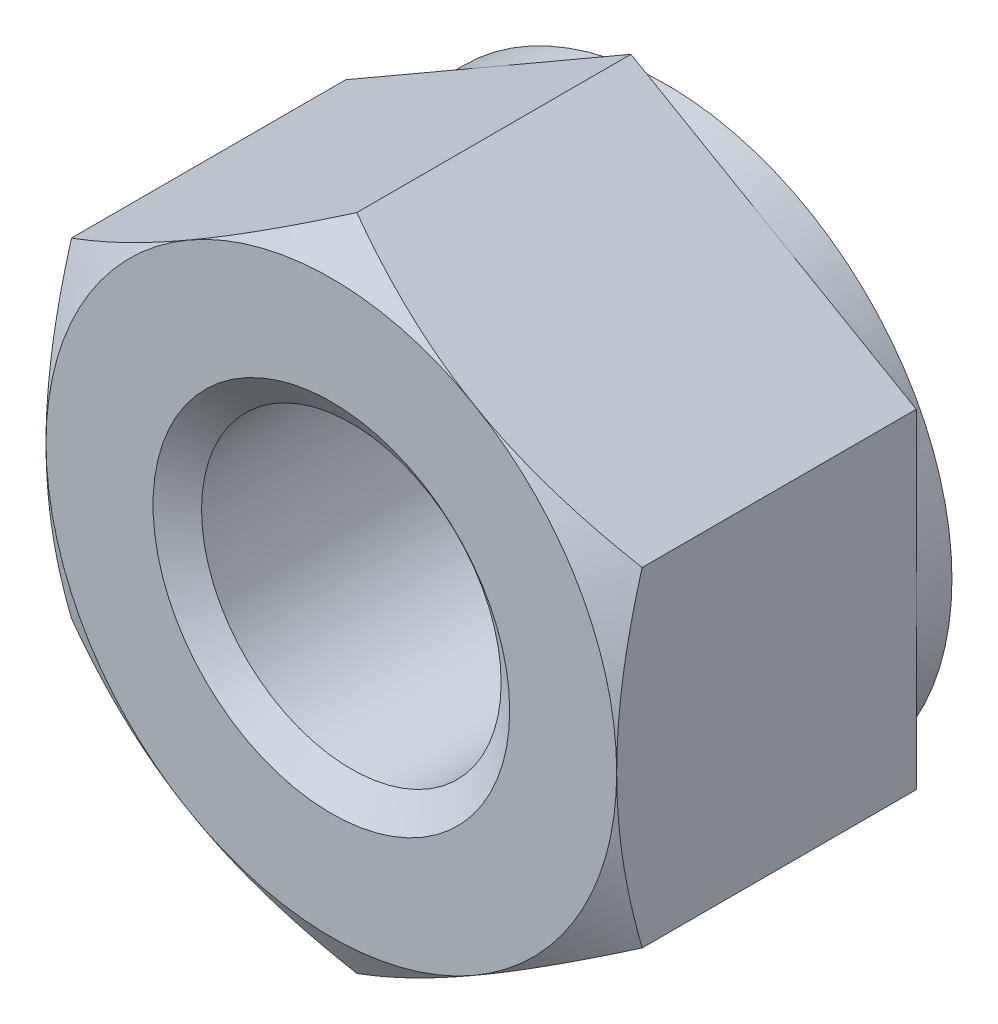
ISO-10303-21;
HEADER;
FILE_DESCRIPTION(('STEP AP214'),'2;1');
FILE_NAME('part.step','',(''),(''),'','','');
FILE_SCHEMA(('AUTOMOTIVE_DESIGN { 1 0 10303 214 1 1 1 1 }'));
ENDSEC;
DATA;
#1=APPLICATION_CONTEXT('core data for automotive mechanical design processes');
#2=APPLICATION_PROTOCOL_DEFINITION('international standard','automotive_design',2000,#1);
#3=PRODUCT_CONTEXT('',#1,'mechanical');
#4=PRODUCT('Part','Part','',(#3));
#5=PRODUCT_RELATED_PRODUCT_CATEGORY('part','',(#4));
#6=PRODUCT_DEFINITION_FORMATION('','',#4);
#7=PRODUCT_DEFINITION_CONTEXT('part definition',#1,'design');
#8=PRODUCT_DEFINITION('design','',#6,#7);
#9=PRODUCT_DEFINITION_SHAPE('','',#8);
#10=(LENGTH_UNIT() NAMED_UNIT(*) SI_UNIT(.MILLI.,.METRE.));
#11=(NAMED_UNIT(*) PLANE_ANGLE_UNIT() SI_UNIT($,.RADIAN.));
#12=(NAMED_UNIT(*) SI_UNIT($,.STERADIAN.) SOLID_ANGLE_UNIT());
#13=UNCERTAINTY_MEASURE_WITH_UNIT(LENGTH_MEASURE(1.E-05),#10,'distance_accuracy_value','');
#14=(GEOMETRIC_REPRESENTATION_CONTEXT(3) GLOBAL_UNCERTAINTY_ASSIGNED_CONTEXT((#13)) GLOBAL_UNIT_ASSIGNED_CONTEXT((#10,
#11,#12)) REPRESENTATION_CONTEXT('',''));
#15=CARTESIAN_POINT('',(0.,0.,0.));
#16=DIRECTION('',(0.,0.,1.));
#17=DIRECTION('',(1.,0.,0.));
#18=AXIS2_PLACEMENT_3D('',#15,#16,#17);
#19=CARTESIAN_POINT('',(0.,0.,-4.7));
#20=DIRECTION('',(0.,0.,1.));
#21=DIRECTION('',(1.,0.,0.));
#22=AXIS2_PLACEMENT_3D('',#19,#20,#21);
#23=CYLINDRICAL_SURFACE('',#22,2.1);
#24=CARTESIAN_POINT('',(0.,0.,-0.280083015283886));
#25=DIRECTION('',(0.,0.,1.));
#26=DIRECTION('',(1.,0.,0.));
#27=AXIS2_PLACEMENT_3D('',#24,#25,#26);
#28=CIRCLE('',#27,2.1);
#29=CARTESIAN_POINT('',(2.1,0.,-0.280083015283886));
#30=VERTEX_POINT('',#29);
#31=EDGE_CURVE('E152',#30,#30,#28,.F.);
#32=ORIENTED_EDGE('',*,*,#31,.F.);
#33=EDGE_LOOP('',(#32));
#34=FACE_BOUND('',#33,.T.);
#35=CARTESIAN_POINT('',(0.,0.,-4.39451698471612));
#36=DIRECTION('',(0.,0.,-1.));
#37=DIRECTION('',(-1.,0.,0.));
#38=AXIS2_PLACEMENT_3D('',#35,#36,#37);
#39=CIRCLE('',#38,2.1);
#40=CARTESIAN_POINT('',(-2.1,0.,-4.39451698471612));
#41=VERTEX_POINT('',#40);
#42=EDGE_CURVE('E40',#41,#41,#39,.F.);
#43=ORIENTED_EDGE('',*,*,#42,.F.);
#44=EDGE_LOOP('',(#43));
#45=FACE_BOUND('',#44,.T.);
#46=ADVANCED_FACE('F35',(#34,#45),#23,.F.);
#47=CARTESIAN_POINT('',(0.,4.61880215351701,-4.7));
#48=DIRECTION('',(-0.500000000000001,0.866025403784438,0.));
#49=DIRECTION('',(-0.866025403784438,-0.500000000000001,0.));
#50=AXIS2_PLACEMENT_3D('',#47,#48,#49);
#51=PLANE('',#50);
#52=DIRECTION('',(0.,0.,1.));
#53=VECTOR('',#52,1.);
#54=CARTESIAN_POINT('',(-4.,2.3094010767585,-4.7));
#55=LINE('',#54,#53);
#56=CARTESIAN_POINT('',(-4.,2.3094010767585,-4.2));
#57=VERTEX_POINT('',#56);
#58=CARTESIAN_POINT('',(-4.,2.3094010767585,-0.357265589908166));
#59=VERTEX_POINT('',#58);
#60=EDGE_CURVE('E290',#57,#59,#55,.T.);
#61=ORIENTED_EDGE('',*,*,#60,.T.);
#62=CARTESIAN_POINT('',(-4.0002,2.30928560670466,-0.357332259074768));
#63=CARTESIAN_POINT('',(-3.82442084967677,2.4107717464617,-0.298717873648284));
#64=CARTESIAN_POINT('',(-3.64712438367362,2.51313390883499,-0.245410321462263));
#65=CARTESIAN_POINT('',(-3.28946140682429,2.71963072479811,-0.152361670746404));
#66=CARTESIAN_POINT('',(-3.10908854102985,2.82376904741904,-0.112653489029704));
#67=CARTESIAN_POINT('',(-2.75057818129721,3.03075510011795,-0.0508422152802784));
#68=CARTESIAN_POINT('',(-2.57249584706486,3.13357098372492,-0.0283277315228883));
#69=CARTESIAN_POINT('',(-2.21549328283349,3.33968651028528,-0.00145062314658124));
#70=CARTESIAN_POINT('',(-2.0365743503559,3.44298540411434,0.00293425857305747));
#71=CARTESIAN_POINT('',(-1.70225715780327,3.63600352522932,-0.00619007293996961));
#72=CARTESIAN_POINT('',(-1.54680884001293,3.72575165335065,-0.0174589539879937));
#73=CARTESIAN_POINT('',(-1.23692494436494,3.90466320392054,-0.0531739907981932));
#74=CARTESIAN_POINT('',(-1.08249043825587,3.99382600759478,-0.0776323457115336));
#75=CARTESIAN_POINT('',(-0.771967672225422,4.17310641015197,-0.138776064919291));
#76=CARTESIAN_POINT('',(-0.615918711936898,4.26320131938131,-0.175720603654865));
#77=CARTESIAN_POINT('',(-0.306148164596161,4.4420474282755,-0.259570072548029));
#78=CARTESIAN_POINT('',(-0.152422609226221,4.53080091904966,-0.306455302212742));
#79=CARTESIAN_POINT('',(0.000199999999999454,4.61891762357085,-0.357332259074769));
#80=B_SPLINE_CURVE_WITH_KNOTS('',3,(#62,#63,#64,#65,#66,#67,#68,#69,#70,#71,#72,#73,#74,#75,#76,
#77,#78,#79),.UNSPECIFIED.,.F.,.F.,(4,2,2,2,2,2,2,2,4),(0.,0.634047835695966,1.26961969224543,
1.88946157213122,2.50854226669297,3.04757825393386,3.58711366126904,4.13861653143764,
4.68903648037743),.UNSPECIFIED.);
#81=CARTESIAN_POINT('',(-2.,3.46410161513775,0.));
#82=VERTEX_POINT('',#81);
#83=EDGE_CURVE('E138',#59,#82,#80,.T.);
#84=ORIENTED_EDGE('',*,*,#83,.T.);
#85=CARTESIAN_POINT('',(0.,4.61880215351701,-0.357265589908165));
#86=VERTEX_POINT('',#85);
#87=EDGE_CURVE('E165',#82,#86,#80,.T.);
#88=ORIENTED_EDGE('',*,*,#87,.T.);
#89=DIRECTION('',(0.,0.,1.));
#90=VECTOR('',#89,1.);
#91=CARTESIAN_POINT('',(0.,4.61880215351701,-4.7));
#92=LINE('',#91,#90);
#93=CARTESIAN_POINT('',(0.,4.61880215351701,-4.2));
#94=VERTEX_POINT('',#93);
#95=EDGE_CURVE('E278',#94,#86,#92,.T.);
#96=ORIENTED_EDGE('',*,*,#95,.F.);
#97=DIRECTION('',(-0.866025403784438,-0.500000000000001,0.));
#98=VECTOR('',#97,1.);
#99=CARTESIAN_POINT('',(0.,4.61880215351701,-4.2));
#100=LINE('',#99,#98);
#101=CARTESIAN_POINT('',(-2.,3.46410161513775,-4.2));
#102=VERTEX_POINT('',#101);
#103=EDGE_CURVE('E266',#94,#102,#100,.T.);
#104=ORIENTED_EDGE('',*,*,#103,.T.);
#105=EDGE_CURVE('E262',#102,#57,#100,.T.);
#106=ORIENTED_EDGE('',*,*,#105,.T.);
#107=EDGE_LOOP('',(#61,#84,#88,#96,#104,#106));
#108=FACE_BOUND('',#107,.T.);
#109=ADVANCED_FACE('F37',(#108),#51,.T.);
#110=CARTESIAN_POINT('',(4.,2.3094010767585,-4.7));
#111=DIRECTION('',(0.500000000000001,0.866025403784438,0.));
#112=DIRECTION('',(-0.866025403784438,0.500000000000001,0.));
#113=AXIS2_PLACEMENT_3D('',#110,#111,#112);
#114=PLANE('',#113);
#115=ORIENTED_EDGE('',*,*,#95,.T.);
#116=CARTESIAN_POINT('',(-0.000199999999999567,4.61891762357085,-0.35733225907477));
#117=CARTESIAN_POINT('',(0.175579150323228,4.51743148381381,-0.298717873648285));
#118=CARTESIAN_POINT('',(0.352875616326382,4.41506932144052,-0.245410321462265));
#119=CARTESIAN_POINT('',(0.710538593175707,4.20857250547739,-0.152361670746404));
#120=CARTESIAN_POINT('',(0.890911458970152,4.10443418285647,-0.112653489029704));
#121=CARTESIAN_POINT('',(1.24942181870279,3.89744813015756,-0.0508422152802787));
#122=CARTESIAN_POINT('',(1.42750415293514,3.79463224655059,-0.0283277315228885));
#123=CARTESIAN_POINT('',(1.78450671716651,3.58851671999023,-0.00145062314658151));
#124=CARTESIAN_POINT('',(1.9634256496441,3.48521782616117,0.00293425857305708));
#125=CARTESIAN_POINT('',(2.29774284219673,3.29219970504619,-0.00619007293996973));
#126=CARTESIAN_POINT('',(2.45319115998707,3.20245157692486,-0.0174589539879935));
#127=CARTESIAN_POINT('',(2.76307505563506,3.02354002635496,-0.0531739907981922));
#128=CARTESIAN_POINT('',(2.91750956174413,2.93437722268072,-0.0776323457115322));
#129=CARTESIAN_POINT('',(3.22803232777458,2.75509682012354,-0.138776064919289));
#130=CARTESIAN_POINT('',(3.3840812880631,2.6650019108942,-0.175720603654863));
#131=CARTESIAN_POINT('',(3.69385183540384,2.486155802,-0.259570072548027));
#132=CARTESIAN_POINT('',(3.84757739077378,2.39740231122584,-0.306455302212741));
#133=CARTESIAN_POINT('',(4.0002,2.30928560670466,-0.357332259074768));
#134=B_SPLINE_CURVE_WITH_KNOTS('',3,(#116,#117,#118,#119,#120,#121,#122,#123,#124,#125,#126,
#127,#128,#129,#130,#131,#132,#133),.UNSPECIFIED.,.F.,.F.,(4,2,2,2,2,2,2,2,4),(0.,
0.634047835695968,1.26961969224544,1.88946157213122,2.50854226669297,3.04757825393386,
3.58711366126904,4.13861653143764,4.68903648037743),.UNSPECIFIED.);
#135=CARTESIAN_POINT('',(2.,3.46410161513775,0.));
#136=VERTEX_POINT('',#135);
#137=EDGE_CURVE('E161',#86,#136,#134,.T.);
#138=ORIENTED_EDGE('',*,*,#137,.T.);
#139=CARTESIAN_POINT('',(4.,2.30940107675851,-0.357265589908165));
#140=VERTEX_POINT('',#139);
#141=EDGE_CURVE('E147',#136,#140,#134,.T.);
#142=ORIENTED_EDGE('',*,*,#141,.T.);
#143=DIRECTION('',(0.,0.,1.));
#144=VECTOR('',#143,1.);
#145=CARTESIAN_POINT('',(4.,2.3094010767585,-4.7));
#146=LINE('',#145,#144);
#147=CARTESIAN_POINT('',(4.,2.3094010767585,-4.2));
#148=VERTEX_POINT('',#147);
#149=EDGE_CURVE('E160',#148,#140,#146,.T.);
#150=ORIENTED_EDGE('',*,*,#149,.F.);
#151=DIRECTION('',(-0.866025403784438,0.500000000000001,0.));
#152=VECTOR('',#151,1.);
#153=CARTESIAN_POINT('',(4.,2.3094010767585,-4.2));
#154=LINE('',#153,#152);
#155=CARTESIAN_POINT('',(2.,3.46410161513775,-4.2));
#156=VERTEX_POINT('',#155);
#157=EDGE_CURVE('E274',#148,#156,#154,.T.);
#158=ORIENTED_EDGE('',*,*,#157,.T.);
#159=EDGE_CURVE('E270',#156,#94,#154,.T.);
#160=ORIENTED_EDGE('',*,*,#159,.T.);
#161=EDGE_LOOP('',(#115,#138,#142,#150,#158,#160));
#162=FACE_BOUND('',#161,.T.);
#163=ADVANCED_FACE('F237',(#162),#114,.T.);
#164=CARTESIAN_POINT('',(4.,2.3094010767585,-4.7));
#165=DIRECTION('',(-1.,0.,0.));
#166=DIRECTION('',(0.,0.,1.));
#167=AXIS2_PLACEMENT_3D('',#164,#165,#166);
#168=PLANE('',#167);
#169=CARTESIAN_POINT('',(4.,-6.12487198995892,-1.91410682124064));
#170=CARTESIAN_POINT('',(4.,-5.94924937038676,-1.8292362707669));
#171=CARTESIAN_POINT('',(4.,-5.77321152095286,-1.7452094038074));
#172=CARTESIAN_POINT('',(4.,-5.42008084777955,-1.57932514679717));
#173=CARTESIAN_POINT('',(4.,-5.24298784779928,-1.49746813236723));
#174=CARTESIAN_POINT('',(4.,-4.88656571686334,-1.33597446305856));
#175=CARTESIAN_POINT('',(4.,-4.70722958889362,-1.25635319506304));
#176=CARTESIAN_POINT('',(4.,-4.34708334747263,-1.1005305854203));
#177=CARTESIAN_POINT('',(4.,-4.16627331143538,-1.02432906550802));
#178=CARTESIAN_POINT('',(4.,-3.80064706744978,-0.875350650394364));
#179=CARTESIAN_POINT('',(4.,-3.6158089282277,-0.802627284215847));
#180=CARTESIAN_POINT('',(4.,-3.24395246794969,-0.662876230959421));
#181=CARTESIAN_POINT('',(4.,-3.05693390695801,-0.595849177566505));
#182=CARTESIAN_POINT('',(4.,-2.68080318253771,-0.469291748430882));
#183=CARTESIAN_POINT('',(4.,-2.49169643712849,-0.409745434783838));
#184=CARTESIAN_POINT('',(4.,-2.11079454635851,-0.300083356544507));
#185=CARTESIAN_POINT('',(4.,-1.91900027185749,-0.249964609676752));
#186=CARTESIAN_POINT('',(4.,-1.532592326982,-0.161590794954042));
#187=CARTESIAN_POINT('',(4.,-1.3379779203165,-0.12333888595654));
#188=CARTESIAN_POINT('',(4.,-0.946402725872554,-0.0612742359223435));
#189=CARTESIAN_POINT('',(4.,-0.749441936019774,-0.0374615076516988));
#190=CARTESIAN_POINT('',(4.,-0.355451989627943,-0.00638181314943616));
#191=CARTESIAN_POINT('',(4.,-0.158431311094012,0.000989900761041246));
#192=CARTESIAN_POINT('',(4.,0.235472085607469,-0.00120406637479577));
#193=CARTESIAN_POINT('',(4.,0.432354826312205,-0.0107653508153507));
#194=CARTESIAN_POINT('',(4.,0.768560635225517,-0.0408787346135909));
#195=CARTESIAN_POINT('',(4.,0.908254618381819,-0.0575092960439103));
#196=CARTESIAN_POINT('',(4.,1.18656349063497,-0.0982134103466924));
#197=CARTESIAN_POINT('',(4.,1.32517820601013,-0.122288137058447));
#198=CARTESIAN_POINT('',(4.,1.73929045452969,-0.204415070950231));
#199=CARTESIAN_POINT('',(4.,2.01284690528722,-0.272348886425154));
#200=CARTESIAN_POINT('',(4.,2.42218253014524,-0.389516359317205));
#201=CARTESIAN_POINT('',(4.,2.56009536361539,-0.431713941811638));
#202=CARTESIAN_POINT('',(4.,2.83448159101404,-0.520284580227763));
#203=CARTESIAN_POINT('',(4.,2.97095590623557,-0.566654756186913));
#204=CARTESIAN_POINT('',(4.,3.24189440516341,-0.662605699180287));
#205=CARTESIAN_POINT('',(4.,3.37636557946838,-0.712166925753502));
#206=CARTESIAN_POINT('',(4.,3.64426461152914,-0.814198353790704));
#207=CARTESIAN_POINT('',(4.,3.77769202239387,-0.866669730963371));
#208=CARTESIAN_POINT('',(4.,3.91063698986684,-0.920309006541794));
#209=B_SPLINE_CURVE_WITH_KNOTS('',3,(#169,#170,#171,#172,#173,#174,#175,#176,#177,#178,#179,
#180,#181,#182,#183,#184,#185,#186,#187,#188,#189,#190,#191,#192,#193,#194,#195,#196,#197,#198,
#199,#200,#201,#202,#203,#204,#205,#206,#207,#208),.UNSPECIFIED.,.F.,.F.,(4,2,2,2,2,2,2,2,2,2,2,
2,2,2,2,2,2,2,2,4),(0.,0.58517179253227,1.17044423059927,1.75906594645989,2.34765694284827,
2.94347400997483,3.53935727210689,4.13394864697601,4.72835161391471,5.32291267067845,
5.91747425310813,6.50823685854037,7.09884609659886,7.52068140825521,7.9425832713084,
8.7870149135983,9.21965281897689,9.65199437116298,10.0819024146297,10.5119854255247),.UNSPECIFIED.);
#210=CARTESIAN_POINT('',(4.,-2.30940107675851,-0.357265589908165));
#211=VERTEX_POINT('',#210);
#212=CARTESIAN_POINT('',(4.,0.,0.));
#213=VERTEX_POINT('',#212);
#214=EDGE_CURVE('E127',#211,#213,#209,.T.);
#215=ORIENTED_EDGE('',*,*,#214,.F.);
#216=DIRECTION('',(0.,0.,1.));
#217=VECTOR('',#216,1.);
#218=CARTESIAN_POINT('',(4.,-2.30940107675851,-4.7));
#219=LINE('',#218,#217);
#220=CARTESIAN_POINT('',(4.,-2.30940107675851,-4.2));
#221=VERTEX_POINT('',#220);
#222=EDGE_CURVE('E283',#221,#211,#219,.T.);
#223=ORIENTED_EDGE('',*,*,#222,.F.);
#224=DIRECTION('',(0.,-1.,0.));
#225=VECTOR('',#224,1.);
#226=CARTESIAN_POINT('',(4.,2.3094010767585,-4.2));
#227=LINE('',#226,#225);
#228=CARTESIAN_POINT('',(4.,0.,-4.2));
#229=VERTEX_POINT('',#228);
#230=EDGE_CURVE('E275',#229,#221,#227,.T.);
#231=ORIENTED_EDGE('',*,*,#230,.F.);
#232=EDGE_CURVE('E277',#148,#229,#227,.T.);
#233=ORIENTED_EDGE('',*,*,#232,.F.);
#234=ORIENTED_EDGE('',*,*,#149,.T.);
#235=EDGE_CURVE('E140',#213,#140,#209,.T.);
#236=ORIENTED_EDGE('',*,*,#235,.F.);
#237=EDGE_LOOP('',(#215,#223,#231,#233,#234,#236));
#238=FACE_BOUND('',#237,.T.);
#239=ADVANCED_FACE('F157',(#238),#168,.F.);
#240=CARTESIAN_POINT('',(0.,-4.61880215351701,-4.7));
#241=DIRECTION('',(0.500000000000001,-0.866025403784438,0.));
#242=DIRECTION('',(0.866025403784438,0.500000000000001,0.));
#243=AXIS2_PLACEMENT_3D('',#240,#241,#242);
#244=PLANE('',#243);
#245=ORIENTED_EDGE('',*,*,#222,.T.);
#246=CARTESIAN_POINT('',(4.0002,-2.30928560670467,-0.35733225907477));
#247=CARTESIAN_POINT('',(3.82442084967677,-2.41077174646171,-0.298717873648285));
#248=CARTESIAN_POINT('',(3.64712438367362,-2.513133908835,-0.245410321462265));
#249=CARTESIAN_POINT('',(3.28946140682429,-2.71963072479812,-0.152361670746405));
#250=CARTESIAN_POINT('',(3.10908854102985,-2.82376904741905,-0.112653489029706));
#251=CARTESIAN_POINT('',(2.75057818129721,-3.03075510011796,-0.0508422152802807));
#252=CARTESIAN_POINT('',(2.57249584706486,-3.13357098372492,-0.0283277315228906));
#253=CARTESIAN_POINT('',(2.21549328283349,-3.33968651028529,-0.00145062314658395));
#254=CARTESIAN_POINT('',(2.0365743503559,-3.44298540411435,0.00293425857305441));
#255=CARTESIAN_POINT('',(1.70225715780327,-3.63600352522933,-0.00619007293997338));
#256=CARTESIAN_POINT('',(1.54680884001293,-3.72575165335065,-0.0174589539879978));
#257=CARTESIAN_POINT('',(1.23692494436494,-3.90466320392055,-0.0531739907981972));
#258=CARTESIAN_POINT('',(1.08249043825587,-3.99382600759479,-0.0776323457115372));
#259=CARTESIAN_POINT('',(0.771967672225421,-4.17310641015198,-0.138776064919294));
#260=CARTESIAN_POINT('',(0.615918711936897,-4.26320131938132,-0.175720603654868));
#261=CARTESIAN_POINT('',(0.30614816459616,-4.44204742827551,-0.259570072548032));
#262=CARTESIAN_POINT('',(0.152422609226221,-4.53080091904967,-0.306455302212746));
#263=CARTESIAN_POINT('',(-0.000199999999999852,-4.61891762357085,-0.357332259074773));
#264=B_SPLINE_CURVE_WITH_KNOTS('',3,(#246,#247,#248,#249,#250,#251,#252,#253,#254,#255,#256,
#257,#258,#259,#260,#261,#262,#263),.UNSPECIFIED.,.F.,.F.,(4,2,2,2,2,2,2,2,4),(0.,
0.634047835695967,1.26961969224544,1.88946157213122,2.50854226669298,3.04757825393386,
3.58711366126904,4.13861653143764,4.68903648037743),.UNSPECIFIED.);
#265=CARTESIAN_POINT('',(2.,-3.46410161513775,0.));
#266=VERTEX_POINT('',#265);
#267=EDGE_CURVE('E133',#211,#266,#264,.T.);
#268=ORIENTED_EDGE('',*,*,#267,.T.);
#269=CARTESIAN_POINT('',(0.,-4.61880215351701,-0.357265589908165));
#270=VERTEX_POINT('',#269);
#271=EDGE_CURVE('E54',#266,#270,#264,.T.);
#272=ORIENTED_EDGE('',*,*,#271,.T.);
#273=DIRECTION('',(0.,0.,1.));
#274=VECTOR('',#273,1.);
#275=CARTESIAN_POINT('',(0.,-4.61880215351701,-4.7));
#276=LINE('',#275,#274);
#277=CARTESIAN_POINT('',(0.,-4.61880215351701,-4.2));
#278=VERTEX_POINT('',#277);
#279=EDGE_CURVE('E285',#278,#270,#276,.T.);
#280=ORIENTED_EDGE('',*,*,#279,.F.);
#281=DIRECTION('',(0.866025403784438,0.500000000000001,0.));
#282=VECTOR('',#281,1.);
#283=CARTESIAN_POINT('',(0.,-4.61880215351701,-4.2));
#284=LINE('',#283,#282);
#285=CARTESIAN_POINT('',(2.00000000000001,-3.46410161513776,-4.2));
#286=VERTEX_POINT('',#285);
#287=EDGE_CURVE('E267',#278,#286,#284,.T.);
#288=ORIENTED_EDGE('',*,*,#287,.T.);
#289=EDGE_CURVE('E271',#286,#221,#284,.T.);
#290=ORIENTED_EDGE('',*,*,#289,.T.);
#291=EDGE_LOOP('',(#245,#268,#272,#280,#288,#290));
#292=FACE_BOUND('',#291,.T.);
#293=ADVANCED_FACE('F218',(#292),#244,.T.);
#294=CARTESIAN_POINT('',(-4.,-2.30940107675851,-4.7));
#295=DIRECTION('',(-0.500000000000001,-0.866025403784438,0.));
#296=DIRECTION('',(0.866025403784438,-0.500000000000001,0.));
#297=AXIS2_PLACEMENT_3D('',#294,#295,#296);
#298=PLANE('',#297);
#299=ORIENTED_EDGE('',*,*,#279,.T.);
#300=CARTESIAN_POINT('',(0.00019999999999975,-4.61891762357085,-0.357332259074773));
#301=CARTESIAN_POINT('',(-0.175579150323228,-4.51743148381381,-0.298717873648288));
#302=CARTESIAN_POINT('',(-0.352875616326382,-4.41506932144052,-0.245410321462268));
#303=CARTESIAN_POINT('',(-0.710538593175708,-4.2085725054774,-0.152361670746408));
#304=CARTESIAN_POINT('',(-0.890911458970153,-4.10443418285647,-0.112653489029708));
#305=CARTESIAN_POINT('',(-1.24942181870279,-3.89744813015756,-0.0508422152802824));
#306=CARTESIAN_POINT('',(-1.42750415293515,-3.7946322465506,-0.0283277315228922));
#307=CARTESIAN_POINT('',(-1.78450671716651,-3.58851671999023,-0.00145062314658461));
#308=CARTESIAN_POINT('',(-1.9634256496441,-3.48521782616117,0.0029342585730545));
#309=CARTESIAN_POINT('',(-2.29774284219674,-3.29219970504619,-0.00619007293997239));
#310=CARTESIAN_POINT('',(-2.45319115998707,-3.20245157692487,-0.0174589539879966));
#311=CARTESIAN_POINT('',(-2.76307505563506,-3.02354002635497,-0.0531739907981955));
#312=CARTESIAN_POINT('',(-2.91750956174413,-2.93437722268073,-0.0776323457115353));
#313=CARTESIAN_POINT('',(-3.22803232777458,-2.75509682012354,-0.138776064919292));
#314=CARTESIAN_POINT('',(-3.3840812880631,-2.6650019108942,-0.175720603654866));
#315=CARTESIAN_POINT('',(-3.69385183540384,-2.48615580200001,-0.25957007254803));
#316=CARTESIAN_POINT('',(-3.84757739077378,-2.39740231122585,-0.306455302212743));
#317=CARTESIAN_POINT('',(-4.0002,-2.30928560670467,-0.357332259074769));
#318=B_SPLINE_CURVE_WITH_KNOTS('',3,(#300,#301,#302,#303,#304,#305,#306,#307,#308,#309,#310,
#311,#312,#313,#314,#315,#316,#317),.UNSPECIFIED.,.F.,.F.,(4,2,2,2,2,2,2,2,4),(0.,
0.634047835695968,1.26961969224544,1.88946157213123,2.50854226669298,3.04757825393386,
3.58711366126904,4.13861653143764,4.68903648037743),.UNSPECIFIED.);
#319=CARTESIAN_POINT('',(-2.,-3.46410161513775,0.));
#320=VERTEX_POINT('',#319);
#321=EDGE_CURVE('E212',#270,#320,#318,.T.);
#322=ORIENTED_EDGE('',*,*,#321,.T.);
#323=CARTESIAN_POINT('',(-4.,-2.30940107675851,-0.357265589908165));
#324=VERTEX_POINT('',#323);
#325=EDGE_CURVE('E61',#320,#324,#318,.T.);
#326=ORIENTED_EDGE('',*,*,#325,.T.);
#327=DIRECTION('',(0.,0.,1.));
#328=VECTOR('',#327,1.);
#329=CARTESIAN_POINT('',(-4.,-2.30940107675851,-4.7));
#330=LINE('',#329,#328);
#331=CARTESIAN_POINT('',(-4.,-2.30940107675851,-4.2));
#332=VERTEX_POINT('',#331);
#333=EDGE_CURVE('E288',#332,#324,#330,.T.);
#334=ORIENTED_EDGE('',*,*,#333,.F.);
#335=DIRECTION('',(0.866025403784438,-0.500000000000001,0.));
#336=VECTOR('',#335,1.);
#337=CARTESIAN_POINT('',(-4.,-2.30940107675851,-4.2));
#338=LINE('',#337,#336);
#339=CARTESIAN_POINT('',(-2.00000000000001,-3.46410161513776,-4.2));
#340=VERTEX_POINT('',#339);
#341=EDGE_CURVE('E257',#332,#340,#338,.T.);
#342=ORIENTED_EDGE('',*,*,#341,.T.);
#343=EDGE_CURVE('E263',#340,#278,#338,.T.);
#344=ORIENTED_EDGE('',*,*,#343,.T.);
#345=EDGE_LOOP('',(#299,#322,#326,#334,#342,#344));
#346=FACE_BOUND('',#345,.T.);
#347=ADVANCED_FACE('F214',(#346),#298,.T.);
#348=CARTESIAN_POINT('',(-4.,2.3094010767585,-4.7));
#349=DIRECTION('',(-1.,0.,0.));
#350=DIRECTION('',(0.,0.,1.));
#351=AXIS2_PLACEMENT_3D('',#348,#349,#350);
#352=PLANE('',#351);
#353=ORIENTED_EDGE('',*,*,#333,.T.);
#354=CARTESIAN_POINT('',(-4.,-6.12487198995892,-1.91410682124064));
#355=CARTESIAN_POINT('',(-4.,-5.94924937038676,-1.8292362707669));
#356=CARTESIAN_POINT('',(-4.,-5.77321152095286,-1.7452094038074));
#357=CARTESIAN_POINT('',(-4.,-5.42008084777954,-1.57932514679716));
#358=CARTESIAN_POINT('',(-4.,-5.24298784779927,-1.49746813236723));
#359=CARTESIAN_POINT('',(-4.,-4.88656571686334,-1.33597446305856));
#360=CARTESIAN_POINT('',(-4.,-4.70722958889362,-1.25635319506304));
#361=CARTESIAN_POINT('',(-4.,-4.34708334747263,-1.1005305854203));
#362=CARTESIAN_POINT('',(-4.,-4.16627331143537,-1.02432906550802));
#363=CARTESIAN_POINT('',(-4.,-3.80064706744977,-0.875350650394363));
#364=CARTESIAN_POINT('',(-4.,-3.6158089282277,-0.802627284215846));
#365=CARTESIAN_POINT('',(-4.,-3.24395246794968,-0.66287623095942));
#366=CARTESIAN_POINT('',(-4.,-3.05693390695801,-0.595849177566505));
#367=CARTESIAN_POINT('',(-4.,-2.6808031825377,-0.469291748430882));
#368=CARTESIAN_POINT('',(-4.,-2.49169643712848,-0.409745434783837));
#369=CARTESIAN_POINT('',(-4.,-2.11079454635851,-0.300083356544507));
#370=CARTESIAN_POINT('',(-4.,-1.91900027185749,-0.249964609676752));
#371=CARTESIAN_POINT('',(-4.,-1.532592326982,-0.161590794954042));
#372=CARTESIAN_POINT('',(-4.,-1.3379779203165,-0.12333888595654));
#373=CARTESIAN_POINT('',(-4.,-0.946402725872553,-0.0612742359223432));
#374=CARTESIAN_POINT('',(-4.,-0.749441936019772,-0.0374615076516987));
#375=CARTESIAN_POINT('',(-4.,-0.355451989627941,-0.00638181314943622));
#376=CARTESIAN_POINT('',(-4.,-0.15843131109401,0.000989900761041407));
#377=CARTESIAN_POINT('',(-4.,0.23547208560747,-0.00120406637479593));
#378=CARTESIAN_POINT('',(-4.,0.432354826312206,-0.0107653508153514));
#379=CARTESIAN_POINT('',(-4.,0.768560635225518,-0.0408787346135914));
#380=CARTESIAN_POINT('',(-4.,0.908254618381821,-0.0575092960439103));
#381=CARTESIAN_POINT('',(-4.,1.18656349063497,-0.0982134103466924));
#382=CARTESIAN_POINT('',(-4.,1.32517820601013,-0.122288137058447));
#383=CARTESIAN_POINT('',(-4.,1.73929045452969,-0.204415070950232));
#384=CARTESIAN_POINT('',(-4.,2.01284690528722,-0.272348886425154));
#385=CARTESIAN_POINT('',(-4.,2.42218253014524,-0.389516359317205));
#386=CARTESIAN_POINT('',(-4.,2.56009536361539,-0.431713941811637));
#387=CARTESIAN_POINT('',(-4.,2.83448159101404,-0.520284580227764));
#388=CARTESIAN_POINT('',(-4.,2.97095590623557,-0.566654756186914));
#389=CARTESIAN_POINT('',(-4.,3.24189440516341,-0.662605699180288));
#390=CARTESIAN_POINT('',(-4.,3.37636557946838,-0.712166925753502));
#391=CARTESIAN_POINT('',(-4.,3.64426461152914,-0.814198353790704));
#392=CARTESIAN_POINT('',(-4.,3.77769202239387,-0.866669730963371));
#393=CARTESIAN_POINT('',(-4.,3.91063698986684,-0.920309006541794));
#394=B_SPLINE_CURVE_WITH_KNOTS('',3,(#354,#355,#356,#357,#358,#359,#360,#361,#362,#363,#364,
#365,#366,#367,#368,#369,#370,#371,#372,#373,#374,#375,#376,#377,#378,#379,#380,#381,#382,#383,
#384,#385,#386,#387,#388,#389,#390,#391,#392,#393),.UNSPECIFIED.,.F.,.F.,(4,2,2,2,2,2,2,2,2,2,2,
2,2,2,2,2,2,2,2,4),(0.,0.585171792532272,1.17044423059927,1.7590659464599,2.34765694284827,
2.94347400997483,3.53935727210689,4.13394864697601,4.72835161391471,5.32291267067845,
5.91747425310813,6.50823685854037,7.09884609659886,7.52068140825521,7.9425832713084,
8.7870149135983,9.21965281897689,9.65199437116298,10.0819024146297,10.5119854255247),.UNSPECIFIED.);
#395=CARTESIAN_POINT('',(-4.,0.,0.));
#396=VERTEX_POINT('',#395);
#397=EDGE_CURVE('E213',#324,#396,#394,.T.);
#398=ORIENTED_EDGE('',*,*,#397,.T.);
#399=EDGE_CURVE('E151',#396,#59,#394,.T.);
#400=ORIENTED_EDGE('',*,*,#399,.T.);
#401=ORIENTED_EDGE('',*,*,#60,.F.);
#402=DIRECTION('',(0.,-1.,0.));
#403=VECTOR('',#402,1.);
#404=CARTESIAN_POINT('',(-4.,2.3094010767585,-4.2));
#405=LINE('',#404,#403);
#406=CARTESIAN_POINT('',(-4.,0.,-4.2));
#407=VERTEX_POINT('',#406);
#408=EDGE_CURVE('E297',#57,#407,#405,.T.);
#409=ORIENTED_EDGE('',*,*,#408,.T.);
#410=EDGE_CURVE('E295',#407,#332,#405,.T.);
#411=ORIENTED_EDGE('',*,*,#410,.T.);
#412=EDGE_LOOP('',(#353,#398,#400,#401,#409,#411));
#413=FACE_BOUND('',#412,.T.);
#414=ADVANCED_FACE('F217',(#413),#352,.T.);
#415=CARTESIAN_POINT('',(-7.99999999999999,0.,0.));
#416=DIRECTION('',(0.,0.,1.));
#417=DIRECTION('',(1.,0.,0.));
#418=AXIS2_PLACEMENT_3D('',#415,#416,#417);
#419=PLANE('',#418);
#420=CARTESIAN_POINT('',(0.,0.,0.));
#421=DIRECTION('',(0.,0.,1.));
#422=DIRECTION('',(1.,0.,0.));
#423=AXIS2_PLACEMENT_3D('',#420,#421,#422);
#424=CIRCLE('',#423,2.5);
#425=CARTESIAN_POINT('',(2.5,0.,0.));
#426=VERTEX_POINT('',#425);
#427=EDGE_CURVE('E300',#426,#426,#424,.T.);
#428=ORIENTED_EDGE('',*,*,#427,.F.);
#429=EDGE_LOOP('',(#428));
#430=FACE_BOUND('',#429,.T.);
#431=CARTESIAN_POINT('',(0.,0.,0.));
#432=DIRECTION('',(0.,0.,1.));
#433=DIRECTION('',(1.,0.,0.));
#434=AXIS2_PLACEMENT_3D('',#431,#432,#433);
#435=CIRCLE('',#434,4.);
#436=EDGE_CURVE('E12',#213,#266,#435,.F.);
#437=ORIENTED_EDGE('',*,*,#436,.F.);
#438=CARTESIAN_POINT('',(0.,0.,0.));
#439=DIRECTION('',(0.,0.,1.));
#440=DIRECTION('',(1.,0.,0.));
#441=AXIS2_PLACEMENT_3D('',#438,#439,#440);
#442=CIRCLE('',#441,4.);
#443=EDGE_CURVE('E144',#213,#136,#442,.T.);
#444=ORIENTED_EDGE('',*,*,#443,.T.);
#445=EDGE_CURVE('E47',#82,#136,#435,.F.);
#446=ORIENTED_EDGE('',*,*,#445,.F.);
#447=EDGE_CURVE('E365',#396,#82,#435,.F.);
#448=ORIENTED_EDGE('',*,*,#447,.F.);
#449=EDGE_CURVE('E367',#320,#396,#435,.F.);
#450=ORIENTED_EDGE('',*,*,#449,.F.);
#451=EDGE_CURVE('E45',#266,#320,#435,.F.);
#452=ORIENTED_EDGE('',*,*,#451,.F.);
#453=EDGE_LOOP('',(#437,#444,#446,#448,#450,#452));
#454=FACE_BOUND('',#453,.T.);
#455=ADVANCED_FACE('F154',(#430,#454),#419,.T.);
#456=CARTESIAN_POINT('',(-7.99999999999999,0.,-4.7));
#457=DIRECTION('',(0.,0.,1.));
#458=DIRECTION('',(1.,0.,0.));
#459=AXIS2_PLACEMENT_3D('',#456,#457,#458);
#460=PLANE('',#459);
#461=CARTESIAN_POINT('',(0.,0.,-4.7));
#462=DIRECTION('',(0.,0.,1.));
#463=DIRECTION('',(1.,0.,0.));
#464=AXIS2_PLACEMENT_3D('',#461,#462,#463);
#465=CIRCLE('',#464,2.5);
#466=CARTESIAN_POINT('',(2.5,0.,-4.7));
#467=VERTEX_POINT('',#466);
#468=EDGE_CURVE('E301',#467,#467,#465,.F.);
#469=ORIENTED_EDGE('',*,*,#468,.F.);
#470=EDGE_LOOP('',(#469));
#471=FACE_BOUND('',#470,.T.);
#472=CARTESIAN_POINT('',(0.,0.,-4.7));
#473=DIRECTION('',(0.,0.,1.));
#474=DIRECTION('',(1.,0.,0.));
#475=AXIS2_PLACEMENT_3D('',#472,#473,#474);
#476=CIRCLE('',#475,4.);
#477=CARTESIAN_POINT('',(4.,0.,-4.7));
#478=VERTEX_POINT('',#477);
#479=EDGE_CURVE('E281',#478,#478,#476,.F.);
#480=ORIENTED_EDGE('',*,*,#479,.T.);
#481=EDGE_LOOP('',(#480));
#482=FACE_BOUND('',#481,.T.);
#483=ADVANCED_FACE('F227',(#471,#482),#460,.F.);
#484=CARTESIAN_POINT('',(0.,14.618802153517,-4.2));
#485=DIRECTION('',(0.,0.,-1.));
#486=DIRECTION('',(-1.,0.,0.));
#487=AXIS2_PLACEMENT_3D('',#484,#485,#486);
#488=PLANE('',#487);
#489=ORIENTED_EDGE('',*,*,#232,.T.);
#490=CARTESIAN_POINT('',(0.,0.,-4.2));
#491=DIRECTION('',(0.,0.,1.));
#492=DIRECTION('',(1.,0.,0.));
#493=AXIS2_PLACEMENT_3D('',#490,#491,#492);
#494=CIRCLE('',#493,4.);
#495=EDGE_CURVE('E254',#229,#156,#494,.T.);
#496=ORIENTED_EDGE('',*,*,#495,.T.);
#497=ORIENTED_EDGE('',*,*,#157,.F.);
#498=EDGE_LOOP('',(#489,#496,#497));
#499=FACE_BOUND('',#498,.T.);
#500=ADVANCED_FACE('F244',(#499),#488,.T.);
#501=ORIENTED_EDGE('',*,*,#230,.T.);
#502=ORIENTED_EDGE('',*,*,#289,.F.);
#503=EDGE_CURVE('E259',#286,#229,#494,.T.);
#504=ORIENTED_EDGE('',*,*,#503,.T.);
#505=EDGE_LOOP('',(#501,#502,#504));
#506=FACE_BOUND('',#505,.T.);
#507=ADVANCED_FACE('F343',(#506),#488,.T.);
#508=EDGE_CURVE('E258',#156,#102,#494,.T.);
#509=ORIENTED_EDGE('',*,*,#508,.T.);
#510=ORIENTED_EDGE('',*,*,#103,.F.);
#511=ORIENTED_EDGE('',*,*,#159,.F.);
#512=EDGE_LOOP('',(#509,#510,#511));
#513=FACE_BOUND('',#512,.T.);
#514=ADVANCED_FACE('F351',(#513),#488,.T.);
#515=ORIENTED_EDGE('',*,*,#343,.F.);
#516=EDGE_CURVE('E382',#340,#286,#494,.T.);
#517=ORIENTED_EDGE('',*,*,#516,.T.);
#518=ORIENTED_EDGE('',*,*,#287,.F.);
#519=EDGE_LOOP('',(#515,#517,#518));
#520=FACE_BOUND('',#519,.T.);
#521=ADVANCED_FACE('F346',(#520),#488,.T.);
#522=EDGE_CURVE('E355',#102,#407,#494,.T.);
#523=ORIENTED_EDGE('',*,*,#522,.T.);
#524=ORIENTED_EDGE('',*,*,#408,.F.);
#525=ORIENTED_EDGE('',*,*,#105,.F.);
#526=EDGE_LOOP('',(#523,#524,#525));
#527=FACE_BOUND('',#526,.T.);
#528=ADVANCED_FACE('F337',(#527),#488,.T.);
#529=CARTESIAN_POINT('',(0.,0.,0.));
#530=DIRECTION('',(0.,0.,1.));
#531=DIRECTION('',(1.,0.,0.));
#532=AXIS2_PLACEMENT_3D('',#529,#530,#531);
#533=CYLINDRICAL_SURFACE('',#532,4.);
#534=ORIENTED_EDGE('',*,*,#479,.F.);
#535=EDGE_LOOP('',(#534));
#536=FACE_BOUND('',#535,.T.);
#537=ORIENTED_EDGE('',*,*,#508,.F.);
#538=ORIENTED_EDGE('',*,*,#495,.F.);
#539=ORIENTED_EDGE('',*,*,#503,.F.);
#540=ORIENTED_EDGE('',*,*,#516,.F.);
#541=EDGE_CURVE('E361',#407,#340,#494,.T.);
#542=ORIENTED_EDGE('',*,*,#541,.F.);
#543=ORIENTED_EDGE('',*,*,#522,.F.);
#544=EDGE_LOOP('',(#537,#538,#539,#540,#542,#543));
#545=FACE_BOUND('',#544,.T.);
#546=ADVANCED_FACE('F242',(#536,#545),#533,.T.);
#547=ORIENTED_EDGE('',*,*,#410,.F.);
#548=ORIENTED_EDGE('',*,*,#541,.T.);
#549=ORIENTED_EDGE('',*,*,#341,.F.);
#550=EDGE_LOOP('',(#547,#548,#549));
#551=FACE_BOUND('',#550,.T.);
#552=ADVANCED_FACE('F195',(#551),#488,.T.);
#553=CARTESIAN_POINT('',(0.,0.,0.));
#554=DIRECTION('',(0.,0.,-1.));
#555=DIRECTION('',(-1.,0.,0.));
#556=AXIS2_PLACEMENT_3D('',#553,#554,#555);
#557=CONICAL_SURFACE('',#556,4.,1.0471975511966);
#558=ORIENTED_EDGE('',*,*,#443,.F.);
#559=ORIENTED_EDGE('',*,*,#235,.T.);
#560=ORIENTED_EDGE('',*,*,#141,.F.);
#561=EDGE_LOOP('',(#558,#559,#560));
#562=FACE_BOUND('',#561,.T.);
#563=ADVANCED_FACE('F145',(#562),#557,.T.);
#564=ORIENTED_EDGE('',*,*,#445,.T.);
#565=ORIENTED_EDGE('',*,*,#137,.F.);
#566=ORIENTED_EDGE('',*,*,#87,.F.);
#567=EDGE_LOOP('',(#564,#565,#566));
#568=FACE_BOUND('',#567,.T.);
#569=ADVANCED_FACE('F192',(#568),#557,.T.);
#570=ORIENTED_EDGE('',*,*,#399,.F.);
#571=ORIENTED_EDGE('',*,*,#447,.T.);
#572=ORIENTED_EDGE('',*,*,#83,.F.);
#573=EDGE_LOOP('',(#570,#571,#572));
#574=FACE_BOUND('',#573,.T.);
#575=ADVANCED_FACE('F191',(#574),#557,.T.);
#576=ORIENTED_EDGE('',*,*,#449,.T.);
#577=ORIENTED_EDGE('',*,*,#397,.F.);
#578=ORIENTED_EDGE('',*,*,#325,.F.);
#579=EDGE_LOOP('',(#576,#577,#578));
#580=FACE_BOUND('',#579,.T.);
#581=ADVANCED_FACE('F185',(#580),#557,.T.);
#582=ORIENTED_EDGE('',*,*,#451,.T.);
#583=ORIENTED_EDGE('',*,*,#321,.F.);
#584=ORIENTED_EDGE('',*,*,#271,.F.);
#585=EDGE_LOOP('',(#582,#583,#584));
#586=FACE_BOUND('',#585,.T.);
#587=ADVANCED_FACE('F190',(#586),#557,.T.);
#588=ORIENTED_EDGE('',*,*,#214,.T.);
#589=ORIENTED_EDGE('',*,*,#436,.T.);
#590=ORIENTED_EDGE('',*,*,#267,.F.);
#591=EDGE_LOOP('',(#588,#589,#590));
#592=FACE_BOUND('',#591,.T.);
#593=ADVANCED_FACE('F129',(#592),#557,.T.);
#594=CARTESIAN_POINT('',(0.,0.,-0.308091316812274));
#595=DIRECTION('',(0.,0.,1.));
#596=DIRECTION('',(1.,0.,0.));
#597=AXIS2_PLACEMENT_3D('',#594,#595,#596);
#598=CONICAL_SURFACE('',#597,2.06,0.959931088596879);
#599=ORIENTED_EDGE('',*,*,#427,.T.);
#600=EDGE_LOOP('',(#599));
#601=FACE_BOUND('',#600,.T.);
#602=ORIENTED_EDGE('',*,*,#31,.T.);
#603=EDGE_LOOP('',(#602));
#604=FACE_BOUND('',#603,.T.);
#605=ADVANCED_FACE('F193',(#601,#604),#598,.F.);
#606=CARTESIAN_POINT('',(0.,0.,-4.6746));
#607=DIRECTION('',(0.,0.,-1.));
#608=DIRECTION('',(-1.,0.,0.));
#609=AXIS2_PLACEMENT_3D('',#606,#607,#608);
#610=CONICAL_SURFACE('',#609,2.5,0.959931088596884);
#611=CARTESIAN_POINT('',(0.,0.,-4.6746));
#612=DIRECTION('',(0.,0.,1.));
#613=DIRECTION('',(1.,0.,0.));
#614=AXIS2_PLACEMENT_3D('',#611,#612,#613);
#615=CIRCLE('',#614,2.5);
#616=CARTESIAN_POINT('',(2.5,0.,-4.6746));
#617=VERTEX_POINT('',#616);
#618=EDGE_CURVE('E303',#617,#617,#615,.T.);
#619=ORIENTED_EDGE('',*,*,#618,.F.);
#620=EDGE_LOOP('',(#619));
#621=FACE_BOUND('',#620,.T.);
#622=ORIENTED_EDGE('',*,*,#42,.T.);
#623=EDGE_LOOP('',(#622));
#624=FACE_BOUND('',#623,.T.);
#625=ADVANCED_FACE('F317',(#621,#624),#610,.F.);
#626=CARTESIAN_POINT('',(0.,0.,-25.0375057290932));
#627=DIRECTION('',(0.,0.,1.));
#628=DIRECTION('',(1.,0.,0.));
#629=AXIS2_PLACEMENT_3D('',#626,#627,#628);
#630=CYLINDRICAL_SURFACE('',#629,2.5);
#631=ORIENTED_EDGE('',*,*,#618,.T.);
#632=EDGE_LOOP('',(#631));
#633=FACE_BOUND('',#632,.T.);
#634=ORIENTED_EDGE('',*,*,#468,.T.);
#635=EDGE_LOOP('',(#634));
#636=FACE_BOUND('',#635,.T.);
#637=ADVANCED_FACE('F322',(#633,#636),#630,.F.);
#638=CLOSED_SHELL('',(#46,#109,#163,#239,#293,#347,#414,#455,#483,#500,#507,#514,#521,#528,#546,
#552,#563,#569,#575,#581,#587,#593,#605,#625,#637));
#639=MANIFOLD_SOLID_BREP('B2',#638);
#640=ADVANCED_BREP_SHAPE_REPRESENTATION('',(#18,#639),#14);
#641=SHAPE_DEFINITION_REPRESENTATION(#9,#640);
ENDSEC;
END-ISO-10303-21;
